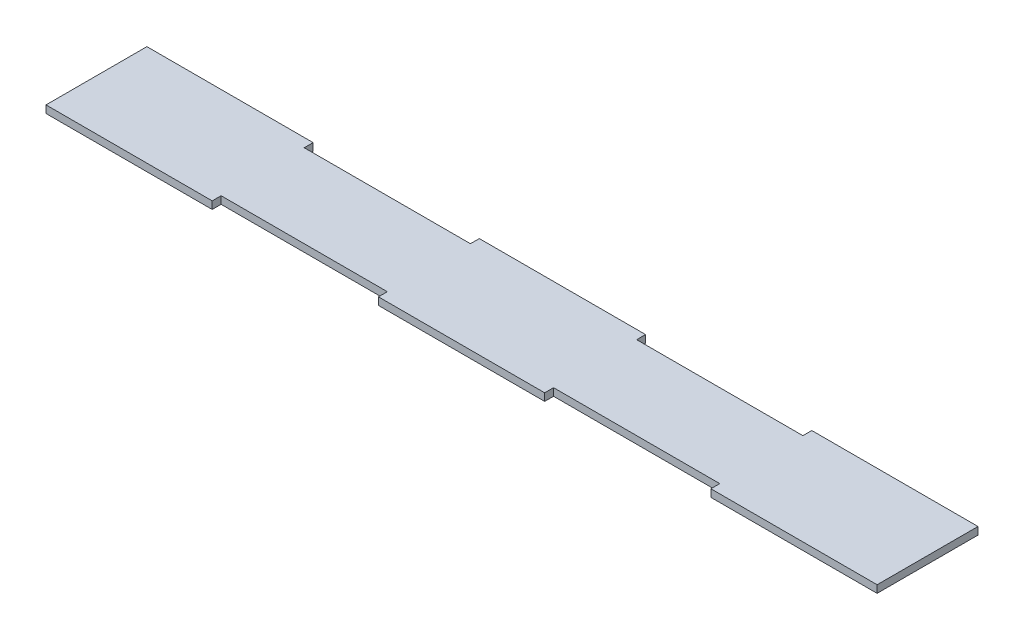
ISO-10303-21;
HEADER;
FILE_DESCRIPTION(('STEP AP214'),'2;1');
FILE_NAME('part.step','',(''),(''),'','','');
FILE_SCHEMA(('AUTOMOTIVE_DESIGN { 1 0 10303 214 1 1 1 1 }'));
ENDSEC;
DATA;
#1=APPLICATION_CONTEXT('core data for automotive mechanical design processes');
#2=APPLICATION_PROTOCOL_DEFINITION('international standard','automotive_design',2000,#1);
#3=PRODUCT_CONTEXT('',#1,'mechanical');
#4=PRODUCT('Part','Part','',(#3));
#5=PRODUCT_RELATED_PRODUCT_CATEGORY('part','',(#4));
#6=PRODUCT_DEFINITION_FORMATION('','',#4);
#7=PRODUCT_DEFINITION_CONTEXT('part definition',#1,'design');
#8=PRODUCT_DEFINITION('design','',#6,#7);
#9=PRODUCT_DEFINITION_SHAPE('','',#8);
#10=(LENGTH_UNIT() NAMED_UNIT(*) SI_UNIT(.MILLI.,.METRE.));
#11=(NAMED_UNIT(*) PLANE_ANGLE_UNIT() SI_UNIT($,.RADIAN.));
#12=(NAMED_UNIT(*) SI_UNIT($,.STERADIAN.) SOLID_ANGLE_UNIT());
#13=UNCERTAINTY_MEASURE_WITH_UNIT(LENGTH_MEASURE(1.E-05),#10,'distance_accuracy_value','');
#14=(GEOMETRIC_REPRESENTATION_CONTEXT(3) GLOBAL_UNCERTAINTY_ASSIGNED_CONTEXT((#13)) GLOBAL_UNIT_ASSIGNED_CONTEXT((#10,
#11,#12)) REPRESENTATION_CONTEXT('',''));
#15=CARTESIAN_POINT('',(0.,0.,0.));
#16=DIRECTION('',(0.,0.,1.));
#17=DIRECTION('',(1.,0.,0.));
#18=AXIS2_PLACEMENT_3D('',#15,#16,#17);
#19=CARTESIAN_POINT('',(150.,2.7,-18.21));
#20=DIRECTION('',(-1.,0.,0.));
#21=DIRECTION('',(0.,0.,1.));
#22=AXIS2_PLACEMENT_3D('',#19,#20,#21);
#23=PLANE('',#22);
#24=DIRECTION('',(0.,0.,-1.));
#25=VECTOR('',#24,1.);
#26=CARTESIAN_POINT('',(150.,0.,-18.21));
#27=LINE('',#26,#25);
#28=CARTESIAN_POINT('',(150.,0.,18.21));
#29=VERTEX_POINT('',#28);
#30=CARTESIAN_POINT('',(150.,0.,-18.21));
#31=VERTEX_POINT('',#30);
#32=EDGE_CURVE('E201',#29,#31,#27,.T.);
#33=ORIENTED_EDGE('',*,*,#32,.T.);
#34=DIRECTION('',(0.,-1.,0.));
#35=VECTOR('',#34,1.);
#36=CARTESIAN_POINT('',(150.,2.7,-18.21));
#37=LINE('',#36,#35);
#38=CARTESIAN_POINT('',(150.,2.7,-18.21));
#39=VERTEX_POINT('',#38);
#40=EDGE_CURVE('E11',#39,#31,#37,.T.);
#41=ORIENTED_EDGE('',*,*,#40,.F.);
#42=DIRECTION('',(0.,0.,-1.));
#43=VECTOR('',#42,1.);
#44=CARTESIAN_POINT('',(150.,2.7,-18.21));
#45=LINE('',#44,#43);
#46=CARTESIAN_POINT('',(150.,2.7,18.21));
#47=VERTEX_POINT('',#46);
#48=EDGE_CURVE('E239',#47,#39,#45,.T.);
#49=ORIENTED_EDGE('',*,*,#48,.F.);
#50=DIRECTION('',(0.,-1.,0.));
#51=VECTOR('',#50,1.);
#52=CARTESIAN_POINT('',(150.,2.7,18.21));
#53=LINE('',#52,#51);
#54=EDGE_CURVE('E197',#47,#29,#53,.T.);
#55=ORIENTED_EDGE('',*,*,#54,.T.);
#56=EDGE_LOOP('',(#33,#41,#49,#55));
#57=FACE_BOUND('',#56,.T.);
#58=ADVANCED_FACE('F33',(#57),#23,.F.);
#59=CARTESIAN_POINT('',(90.,2.7,-18.21));
#60=DIRECTION('',(0.,0.,1.));
#61=DIRECTION('',(1.,0.,0.));
#62=AXIS2_PLACEMENT_3D('',#59,#60,#61);
#63=PLANE('',#62);
#64=DIRECTION('',(-1.,0.,0.));
#65=VECTOR('',#64,1.);
#66=CARTESIAN_POINT('',(90.,0.,-18.21));
#67=LINE('',#66,#65);
#68=CARTESIAN_POINT('',(90.,0.,-18.21));
#69=VERTEX_POINT('',#68);
#70=EDGE_CURVE('E204',#31,#69,#67,.T.);
#71=ORIENTED_EDGE('',*,*,#70,.T.);
#72=DIRECTION('',(0.,-1.,0.));
#73=VECTOR('',#72,1.);
#74=CARTESIAN_POINT('',(90.,2.7,-18.21));
#75=LINE('',#74,#73);
#76=CARTESIAN_POINT('',(90.,2.7,-18.21));
#77=VERTEX_POINT('',#76);
#78=EDGE_CURVE('E41',#77,#69,#75,.T.);
#79=ORIENTED_EDGE('',*,*,#78,.F.);
#80=DIRECTION('',(-1.,0.,0.));
#81=VECTOR('',#80,1.);
#82=CARTESIAN_POINT('',(90.,2.7,-18.21));
#83=LINE('',#82,#81);
#84=EDGE_CURVE('E128',#39,#77,#83,.T.);
#85=ORIENTED_EDGE('',*,*,#84,.F.);
#86=ORIENTED_EDGE('',*,*,#40,.T.);
#87=EDGE_LOOP('',(#71,#79,#85,#86));
#88=FACE_BOUND('',#87,.T.);
#89=ADVANCED_FACE('F357',(#88),#63,.F.);
#90=CARTESIAN_POINT('',(90.,2.7,-18.21));
#91=DIRECTION('',(1.,0.,0.));
#92=DIRECTION('',(0.,0.,-1.));
#93=AXIS2_PLACEMENT_3D('',#90,#91,#92);
#94=PLANE('',#93);
#95=DIRECTION('',(0.,0.,1.));
#96=VECTOR('',#95,1.);
#97=CARTESIAN_POINT('',(90.,0.,-18.21));
#98=LINE('',#97,#96);
#99=CARTESIAN_POINT('',(90.,0.,-15.));
#100=VERTEX_POINT('',#99);
#101=EDGE_CURVE('E206',#69,#100,#98,.T.);
#102=ORIENTED_EDGE('',*,*,#101,.T.);
#103=DIRECTION('',(0.,-1.,0.));
#104=VECTOR('',#103,1.);
#105=CARTESIAN_POINT('',(90.,2.7,-15.));
#106=LINE('',#105,#104);
#107=CARTESIAN_POINT('',(90.,2.7,-15.));
#108=VERTEX_POINT('',#107);
#109=EDGE_CURVE('E282',#108,#100,#106,.T.);
#110=ORIENTED_EDGE('',*,*,#109,.F.);
#111=DIRECTION('',(0.,0.,1.));
#112=VECTOR('',#111,1.);
#113=CARTESIAN_POINT('',(90.,2.7,-18.21));
#114=LINE('',#113,#112);
#115=EDGE_CURVE('E290',#77,#108,#114,.T.);
#116=ORIENTED_EDGE('',*,*,#115,.F.);
#117=ORIENTED_EDGE('',*,*,#78,.T.);
#118=EDGE_LOOP('',(#102,#110,#116,#117));
#119=FACE_BOUND('',#118,.T.);
#120=ADVANCED_FACE('F288',(#119),#94,.F.);
#121=CARTESIAN_POINT('',(30.,2.7,-15.));
#122=DIRECTION('',(0.,0.,1.));
#123=DIRECTION('',(1.,0.,0.));
#124=AXIS2_PLACEMENT_3D('',#121,#122,#123);
#125=PLANE('',#124);
#126=DIRECTION('',(-1.,0.,0.));
#127=VECTOR('',#126,1.);
#128=CARTESIAN_POINT('',(30.,0.,-15.));
#129=LINE('',#128,#127);
#130=CARTESIAN_POINT('',(30.,0.,-15.));
#131=VERTEX_POINT('',#130);
#132=EDGE_CURVE('E208',#100,#131,#129,.T.);
#133=ORIENTED_EDGE('',*,*,#132,.T.);
#134=DIRECTION('',(0.,-1.,0.));
#135=VECTOR('',#134,1.);
#136=CARTESIAN_POINT('',(30.,2.7,-15.));
#137=LINE('',#136,#135);
#138=CARTESIAN_POINT('',(30.,2.7,-15.));
#139=VERTEX_POINT('',#138);
#140=EDGE_CURVE('E279',#139,#131,#137,.T.);
#141=ORIENTED_EDGE('',*,*,#140,.F.);
#142=DIRECTION('',(-1.,0.,0.));
#143=VECTOR('',#142,1.);
#144=CARTESIAN_POINT('',(30.,2.7,-15.));
#145=LINE('',#144,#143);
#146=EDGE_CURVE('E308',#108,#139,#145,.T.);
#147=ORIENTED_EDGE('',*,*,#146,.F.);
#148=ORIENTED_EDGE('',*,*,#109,.T.);
#149=EDGE_LOOP('',(#133,#141,#147,#148));
#150=FACE_BOUND('',#149,.T.);
#151=ADVANCED_FACE('F299',(#150),#125,.F.);
#152=CARTESIAN_POINT('',(30.,2.7,-18.21));
#153=DIRECTION('',(-1.,0.,0.));
#154=DIRECTION('',(0.,0.,1.));
#155=AXIS2_PLACEMENT_3D('',#152,#153,#154);
#156=PLANE('',#155);
#157=DIRECTION('',(0.,0.,-1.));
#158=VECTOR('',#157,1.);
#159=CARTESIAN_POINT('',(30.,0.,-18.21));
#160=LINE('',#159,#158);
#161=CARTESIAN_POINT('',(30.,0.,-18.21));
#162=VERTEX_POINT('',#161);
#163=EDGE_CURVE('E210',#131,#162,#160,.T.);
#164=ORIENTED_EDGE('',*,*,#163,.T.);
#165=DIRECTION('',(0.,-1.,0.));
#166=VECTOR('',#165,1.);
#167=CARTESIAN_POINT('',(30.,2.7,-18.21));
#168=LINE('',#167,#166);
#169=CARTESIAN_POINT('',(30.,2.7,-18.21));
#170=VERTEX_POINT('',#169);
#171=EDGE_CURVE('E276',#170,#162,#168,.T.);
#172=ORIENTED_EDGE('',*,*,#171,.F.);
#173=DIRECTION('',(0.,0.,-1.));
#174=VECTOR('',#173,1.);
#175=CARTESIAN_POINT('',(30.,2.7,-18.21));
#176=LINE('',#175,#174);
#177=EDGE_CURVE('E305',#139,#170,#176,.T.);
#178=ORIENTED_EDGE('',*,*,#177,.F.);
#179=ORIENTED_EDGE('',*,*,#140,.T.);
#180=EDGE_LOOP('',(#164,#172,#178,#179));
#181=FACE_BOUND('',#180,.T.);
#182=ADVANCED_FACE('F303',(#181),#156,.F.);
#183=CARTESIAN_POINT('',(-30.,2.7,-18.21));
#184=DIRECTION('',(0.,0.,1.));
#185=DIRECTION('',(1.,0.,0.));
#186=AXIS2_PLACEMENT_3D('',#183,#184,#185);
#187=PLANE('',#186);
#188=DIRECTION('',(-1.,0.,0.));
#189=VECTOR('',#188,1.);
#190=CARTESIAN_POINT('',(-30.,0.,-18.21));
#191=LINE('',#190,#189);
#192=CARTESIAN_POINT('',(-30.,0.,-18.21));
#193=VERTEX_POINT('',#192);
#194=EDGE_CURVE('E212',#162,#193,#191,.T.);
#195=ORIENTED_EDGE('',*,*,#194,.T.);
#196=DIRECTION('',(0.,-1.,0.));
#197=VECTOR('',#196,1.);
#198=CARTESIAN_POINT('',(-30.,2.7,-18.21));
#199=LINE('',#198,#197);
#200=CARTESIAN_POINT('',(-30.,2.7,-18.21));
#201=VERTEX_POINT('',#200);
#202=EDGE_CURVE('E273',#201,#193,#199,.T.);
#203=ORIENTED_EDGE('',*,*,#202,.F.);
#204=DIRECTION('',(-1.,0.,0.));
#205=VECTOR('',#204,1.);
#206=CARTESIAN_POINT('',(-30.,2.7,-18.21));
#207=LINE('',#206,#205);
#208=EDGE_CURVE('E307',#170,#201,#207,.T.);
#209=ORIENTED_EDGE('',*,*,#208,.F.);
#210=ORIENTED_EDGE('',*,*,#171,.T.);
#211=EDGE_LOOP('',(#195,#203,#209,#210));
#212=FACE_BOUND('',#211,.T.);
#213=ADVANCED_FACE('F370',(#212),#187,.F.);
#214=CARTESIAN_POINT('',(-30.,2.7,-18.21));
#215=DIRECTION('',(1.,0.,0.));
#216=DIRECTION('',(0.,0.,-1.));
#217=AXIS2_PLACEMENT_3D('',#214,#215,#216);
#218=PLANE('',#217);
#219=DIRECTION('',(0.,0.,1.));
#220=VECTOR('',#219,1.);
#221=CARTESIAN_POINT('',(-30.,0.,-18.21));
#222=LINE('',#221,#220);
#223=CARTESIAN_POINT('',(-30.,0.,-15.));
#224=VERTEX_POINT('',#223);
#225=EDGE_CURVE('E214',#193,#224,#222,.T.);
#226=ORIENTED_EDGE('',*,*,#225,.T.);
#227=DIRECTION('',(0.,-1.,0.));
#228=VECTOR('',#227,1.);
#229=CARTESIAN_POINT('',(-30.,2.7,-15.));
#230=LINE('',#229,#228);
#231=CARTESIAN_POINT('',(-30.,2.7,-15.));
#232=VERTEX_POINT('',#231);
#233=EDGE_CURVE('E270',#232,#224,#230,.T.);
#234=ORIENTED_EDGE('',*,*,#233,.F.);
#235=DIRECTION('',(0.,0.,1.));
#236=VECTOR('',#235,1.);
#237=CARTESIAN_POINT('',(-30.,2.7,-18.21));
#238=LINE('',#237,#236);
#239=EDGE_CURVE('E310',#201,#232,#238,.T.);
#240=ORIENTED_EDGE('',*,*,#239,.F.);
#241=ORIENTED_EDGE('',*,*,#202,.T.);
#242=EDGE_LOOP('',(#226,#234,#240,#241));
#243=FACE_BOUND('',#242,.T.);
#244=ADVANCED_FACE('F373',(#243),#218,.F.);
#245=CARTESIAN_POINT('',(-90.,2.7,-15.));
#246=DIRECTION('',(0.,0.,1.));
#247=DIRECTION('',(1.,0.,0.));
#248=AXIS2_PLACEMENT_3D('',#245,#246,#247);
#249=PLANE('',#248);
#250=DIRECTION('',(-1.,0.,0.));
#251=VECTOR('',#250,1.);
#252=CARTESIAN_POINT('',(-90.,0.,-15.));
#253=LINE('',#252,#251);
#254=CARTESIAN_POINT('',(-90.,0.,-15.));
#255=VERTEX_POINT('',#254);
#256=EDGE_CURVE('E216',#224,#255,#253,.T.);
#257=ORIENTED_EDGE('',*,*,#256,.T.);
#258=DIRECTION('',(0.,-1.,0.));
#259=VECTOR('',#258,1.);
#260=CARTESIAN_POINT('',(-90.,2.7,-15.));
#261=LINE('',#260,#259);
#262=CARTESIAN_POINT('',(-90.,2.7,-15.));
#263=VERTEX_POINT('',#262);
#264=EDGE_CURVE('E267',#263,#255,#261,.T.);
#265=ORIENTED_EDGE('',*,*,#264,.F.);
#266=DIRECTION('',(-1.,0.,0.));
#267=VECTOR('',#266,1.);
#268=CARTESIAN_POINT('',(-90.,2.7,-15.));
#269=LINE('',#268,#267);
#270=EDGE_CURVE('E316',#232,#263,#269,.T.);
#271=ORIENTED_EDGE('',*,*,#270,.F.);
#272=ORIENTED_EDGE('',*,*,#233,.T.);
#273=EDGE_LOOP('',(#257,#265,#271,#272));
#274=FACE_BOUND('',#273,.T.);
#275=ADVANCED_FACE('F377',(#274),#249,.F.);
#276=CARTESIAN_POINT('',(-90.,2.7,-18.21));
#277=DIRECTION('',(-1.,0.,0.));
#278=DIRECTION('',(0.,0.,1.));
#279=AXIS2_PLACEMENT_3D('',#276,#277,#278);
#280=PLANE('',#279);
#281=DIRECTION('',(0.,0.,-1.));
#282=VECTOR('',#281,1.);
#283=CARTESIAN_POINT('',(-90.,0.,-18.21));
#284=LINE('',#283,#282);
#285=CARTESIAN_POINT('',(-90.,0.,-18.21));
#286=VERTEX_POINT('',#285);
#287=EDGE_CURVE('E218',#255,#286,#284,.T.);
#288=ORIENTED_EDGE('',*,*,#287,.T.);
#289=DIRECTION('',(0.,-1.,0.));
#290=VECTOR('',#289,1.);
#291=CARTESIAN_POINT('',(-90.,2.7,-18.21));
#292=LINE('',#291,#290);
#293=CARTESIAN_POINT('',(-90.,2.7,-18.21));
#294=VERTEX_POINT('',#293);
#295=EDGE_CURVE('E264',#294,#286,#292,.T.);
#296=ORIENTED_EDGE('',*,*,#295,.F.);
#297=DIRECTION('',(0.,0.,-1.));
#298=VECTOR('',#297,1.);
#299=CARTESIAN_POINT('',(-90.,2.7,-18.21));
#300=LINE('',#299,#298);
#301=EDGE_CURVE('E318',#263,#294,#300,.T.);
#302=ORIENTED_EDGE('',*,*,#301,.F.);
#303=ORIENTED_EDGE('',*,*,#264,.T.);
#304=EDGE_LOOP('',(#288,#296,#302,#303));
#305=FACE_BOUND('',#304,.T.);
#306=ADVANCED_FACE('F381',(#305),#280,.F.);
#307=CARTESIAN_POINT('',(-150.,2.7,-18.21));
#308=DIRECTION('',(0.,0.,1.));
#309=DIRECTION('',(1.,0.,0.));
#310=AXIS2_PLACEMENT_3D('',#307,#308,#309);
#311=PLANE('',#310);
#312=DIRECTION('',(-1.,0.,0.));
#313=VECTOR('',#312,1.);
#314=CARTESIAN_POINT('',(-150.,0.,-18.21));
#315=LINE('',#314,#313);
#316=CARTESIAN_POINT('',(-150.,0.,-18.21));
#317=VERTEX_POINT('',#316);
#318=EDGE_CURVE('E220',#286,#317,#315,.T.);
#319=ORIENTED_EDGE('',*,*,#318,.T.);
#320=DIRECTION('',(0.,-1.,0.));
#321=VECTOR('',#320,1.);
#322=CARTESIAN_POINT('',(-150.,2.7,-18.21));
#323=LINE('',#322,#321);
#324=CARTESIAN_POINT('',(-150.,2.7,-18.21));
#325=VERTEX_POINT('',#324);
#326=EDGE_CURVE('E261',#325,#317,#323,.T.);
#327=ORIENTED_EDGE('',*,*,#326,.F.);
#328=DIRECTION('',(-1.,0.,0.));
#329=VECTOR('',#328,1.);
#330=CARTESIAN_POINT('',(-150.,2.7,-18.21));
#331=LINE('',#330,#329);
#332=EDGE_CURVE('E320',#294,#325,#331,.T.);
#333=ORIENTED_EDGE('',*,*,#332,.F.);
#334=ORIENTED_EDGE('',*,*,#295,.T.);
#335=EDGE_LOOP('',(#319,#327,#333,#334));
#336=FACE_BOUND('',#335,.T.);
#337=ADVANCED_FACE('F385',(#336),#311,.F.);
#338=CARTESIAN_POINT('',(-150.,2.7,-18.21));
#339=DIRECTION('',(1.,0.,0.));
#340=DIRECTION('',(0.,0.,-1.));
#341=AXIS2_PLACEMENT_3D('',#338,#339,#340);
#342=PLANE('',#341);
#343=DIRECTION('',(0.,0.,1.));
#344=VECTOR('',#343,1.);
#345=CARTESIAN_POINT('',(-150.,0.,-18.21));
#346=LINE('',#345,#344);
#347=CARTESIAN_POINT('',(-150.,0.,18.21));
#348=VERTEX_POINT('',#347);
#349=EDGE_CURVE('E222',#317,#348,#346,.T.);
#350=ORIENTED_EDGE('',*,*,#349,.T.);
#351=DIRECTION('',(0.,-1.,0.));
#352=VECTOR('',#351,1.);
#353=CARTESIAN_POINT('',(-150.,2.7,18.21));
#354=LINE('',#353,#352);
#355=CARTESIAN_POINT('',(-150.,2.7,18.21));
#356=VERTEX_POINT('',#355);
#357=EDGE_CURVE('E258',#356,#348,#354,.T.);
#358=ORIENTED_EDGE('',*,*,#357,.F.);
#359=DIRECTION('',(0.,0.,1.));
#360=VECTOR('',#359,1.);
#361=CARTESIAN_POINT('',(-150.,2.7,-18.21));
#362=LINE('',#361,#360);
#363=EDGE_CURVE('E322',#325,#356,#362,.T.);
#364=ORIENTED_EDGE('',*,*,#363,.F.);
#365=ORIENTED_EDGE('',*,*,#326,.T.);
#366=EDGE_LOOP('',(#350,#358,#364,#365));
#367=FACE_BOUND('',#366,.T.);
#368=ADVANCED_FACE('F389',(#367),#342,.F.);
#369=CARTESIAN_POINT('',(-150.,2.7,18.21));
#370=DIRECTION('',(0.,0.,-1.));
#371=DIRECTION('',(-1.,0.,0.));
#372=AXIS2_PLACEMENT_3D('',#369,#370,#371);
#373=PLANE('',#372);
#374=DIRECTION('',(1.,0.,0.));
#375=VECTOR('',#374,1.);
#376=CARTESIAN_POINT('',(-150.,0.,18.21));
#377=LINE('',#376,#375);
#378=CARTESIAN_POINT('',(-90.,0.,18.21));
#379=VERTEX_POINT('',#378);
#380=EDGE_CURVE('E224',#348,#379,#377,.T.);
#381=ORIENTED_EDGE('',*,*,#380,.T.);
#382=DIRECTION('',(0.,-1.,0.));
#383=VECTOR('',#382,1.);
#384=CARTESIAN_POINT('',(-90.,2.7,18.21));
#385=LINE('',#384,#383);
#386=CARTESIAN_POINT('',(-90.,2.7,18.21));
#387=VERTEX_POINT('',#386);
#388=EDGE_CURVE('E255',#387,#379,#385,.T.);
#389=ORIENTED_EDGE('',*,*,#388,.F.);
#390=DIRECTION('',(1.,0.,0.));
#391=VECTOR('',#390,1.);
#392=CARTESIAN_POINT('',(-150.,2.7,18.21));
#393=LINE('',#392,#391);
#394=EDGE_CURVE('E324',#356,#387,#393,.T.);
#395=ORIENTED_EDGE('',*,*,#394,.F.);
#396=ORIENTED_EDGE('',*,*,#357,.T.);
#397=EDGE_LOOP('',(#381,#389,#395,#396));
#398=FACE_BOUND('',#397,.T.);
#399=ADVANCED_FACE('F393',(#398),#373,.F.);
#400=CARTESIAN_POINT('',(-90.,2.7,15.));
#401=DIRECTION('',(-1.,0.,0.));
#402=DIRECTION('',(0.,0.,1.));
#403=AXIS2_PLACEMENT_3D('',#400,#401,#402);
#404=PLANE('',#403);
#405=DIRECTION('',(0.,0.,-1.));
#406=VECTOR('',#405,1.);
#407=CARTESIAN_POINT('',(-90.,0.,15.));
#408=LINE('',#407,#406);
#409=CARTESIAN_POINT('',(-90.,0.,15.));
#410=VERTEX_POINT('',#409);
#411=EDGE_CURVE('E226',#379,#410,#408,.T.);
#412=ORIENTED_EDGE('',*,*,#411,.T.);
#413=DIRECTION('',(0.,-1.,0.));
#414=VECTOR('',#413,1.);
#415=CARTESIAN_POINT('',(-90.,2.7,15.));
#416=LINE('',#415,#414);
#417=CARTESIAN_POINT('',(-90.,2.7,15.));
#418=VERTEX_POINT('',#417);
#419=EDGE_CURVE('E252',#418,#410,#416,.T.);
#420=ORIENTED_EDGE('',*,*,#419,.F.);
#421=DIRECTION('',(0.,0.,-1.));
#422=VECTOR('',#421,1.);
#423=CARTESIAN_POINT('',(-90.,2.7,15.));
#424=LINE('',#423,#422);
#425=EDGE_CURVE('E326',#387,#418,#424,.T.);
#426=ORIENTED_EDGE('',*,*,#425,.F.);
#427=ORIENTED_EDGE('',*,*,#388,.T.);
#428=EDGE_LOOP('',(#412,#420,#426,#427));
#429=FACE_BOUND('',#428,.T.);
#430=ADVANCED_FACE('F397',(#429),#404,.F.);
#431=CARTESIAN_POINT('',(-90.,2.7,15.));
#432=DIRECTION('',(0.,0.,-1.));
#433=DIRECTION('',(-1.,0.,0.));
#434=AXIS2_PLACEMENT_3D('',#431,#432,#433);
#435=PLANE('',#434);
#436=DIRECTION('',(1.,0.,0.));
#437=VECTOR('',#436,1.);
#438=CARTESIAN_POINT('',(-90.,0.,15.));
#439=LINE('',#438,#437);
#440=CARTESIAN_POINT('',(-30.,0.,15.));
#441=VERTEX_POINT('',#440);
#442=EDGE_CURVE('E228',#410,#441,#439,.T.);
#443=ORIENTED_EDGE('',*,*,#442,.T.);
#444=DIRECTION('',(0.,-1.,0.));
#445=VECTOR('',#444,1.);
#446=CARTESIAN_POINT('',(-30.,2.7,15.));
#447=LINE('',#446,#445);
#448=CARTESIAN_POINT('',(-30.,2.7,15.));
#449=VERTEX_POINT('',#448);
#450=EDGE_CURVE('E249',#449,#441,#447,.T.);
#451=ORIENTED_EDGE('',*,*,#450,.F.);
#452=DIRECTION('',(1.,0.,0.));
#453=VECTOR('',#452,1.);
#454=CARTESIAN_POINT('',(-90.,2.7,15.));
#455=LINE('',#454,#453);
#456=EDGE_CURVE('E328',#418,#449,#455,.T.);
#457=ORIENTED_EDGE('',*,*,#456,.F.);
#458=ORIENTED_EDGE('',*,*,#419,.T.);
#459=EDGE_LOOP('',(#443,#451,#457,#458));
#460=FACE_BOUND('',#459,.T.);
#461=ADVANCED_FACE('F401',(#460),#435,.F.);
#462=CARTESIAN_POINT('',(-30.,2.7,18.21));
#463=DIRECTION('',(1.,0.,0.));
#464=DIRECTION('',(0.,0.,-1.));
#465=AXIS2_PLACEMENT_3D('',#462,#463,#464);
#466=PLANE('',#465);
#467=DIRECTION('',(0.,0.,1.));
#468=VECTOR('',#467,1.);
#469=CARTESIAN_POINT('',(-30.,0.,18.21));
#470=LINE('',#469,#468);
#471=CARTESIAN_POINT('',(-30.,0.,18.21));
#472=VERTEX_POINT('',#471);
#473=EDGE_CURVE('E230',#441,#472,#470,.T.);
#474=ORIENTED_EDGE('',*,*,#473,.T.);
#475=DIRECTION('',(0.,-1.,0.));
#476=VECTOR('',#475,1.);
#477=CARTESIAN_POINT('',(-30.,2.7,18.21));
#478=LINE('',#477,#476);
#479=CARTESIAN_POINT('',(-30.,2.7,18.21));
#480=VERTEX_POINT('',#479);
#481=EDGE_CURVE('E246',#480,#472,#478,.T.);
#482=ORIENTED_EDGE('',*,*,#481,.F.);
#483=DIRECTION('',(0.,0.,1.));
#484=VECTOR('',#483,1.);
#485=CARTESIAN_POINT('',(-30.,2.7,18.21));
#486=LINE('',#485,#484);
#487=EDGE_CURVE('E330',#449,#480,#486,.T.);
#488=ORIENTED_EDGE('',*,*,#487,.F.);
#489=ORIENTED_EDGE('',*,*,#450,.T.);
#490=EDGE_LOOP('',(#474,#482,#488,#489));
#491=FACE_BOUND('',#490,.T.);
#492=ADVANCED_FACE('F405',(#491),#466,.F.);
#493=CARTESIAN_POINT('',(-30.,2.7,18.21));
#494=DIRECTION('',(0.,0.,-1.));
#495=DIRECTION('',(-1.,0.,0.));
#496=AXIS2_PLACEMENT_3D('',#493,#494,#495);
#497=PLANE('',#496);
#498=DIRECTION('',(1.,0.,0.));
#499=VECTOR('',#498,1.);
#500=CARTESIAN_POINT('',(-30.,0.,18.21));
#501=LINE('',#500,#499);
#502=CARTESIAN_POINT('',(30.,0.,18.21));
#503=VERTEX_POINT('',#502);
#504=EDGE_CURVE('E232',#472,#503,#501,.T.);
#505=ORIENTED_EDGE('',*,*,#504,.T.);
#506=DIRECTION('',(0.,-1.,0.));
#507=VECTOR('',#506,1.);
#508=CARTESIAN_POINT('',(30.,2.7,18.21));
#509=LINE('',#508,#507);
#510=CARTESIAN_POINT('',(30.,2.7,18.21));
#511=VERTEX_POINT('',#510);
#512=EDGE_CURVE('E243',#511,#503,#509,.T.);
#513=ORIENTED_EDGE('',*,*,#512,.F.);
#514=DIRECTION('',(1.,0.,0.));
#515=VECTOR('',#514,1.);
#516=CARTESIAN_POINT('',(-30.,2.7,18.21));
#517=LINE('',#516,#515);
#518=EDGE_CURVE('E332',#480,#511,#517,.T.);
#519=ORIENTED_EDGE('',*,*,#518,.F.);
#520=ORIENTED_EDGE('',*,*,#481,.T.);
#521=EDGE_LOOP('',(#505,#513,#519,#520));
#522=FACE_BOUND('',#521,.T.);
#523=ADVANCED_FACE('F338',(#522),#497,.F.);
#524=CARTESIAN_POINT('',(30.,2.7,18.21));
#525=DIRECTION('',(-1.,0.,0.));
#526=DIRECTION('',(0.,0.,1.));
#527=AXIS2_PLACEMENT_3D('',#524,#525,#526);
#528=PLANE('',#527);
#529=DIRECTION('',(0.,0.,-1.));
#530=VECTOR('',#529,1.);
#531=CARTESIAN_POINT('',(30.,0.,18.21));
#532=LINE('',#531,#530);
#533=CARTESIAN_POINT('',(30.,0.,15.));
#534=VERTEX_POINT('',#533);
#535=EDGE_CURVE('E234',#503,#534,#532,.T.);
#536=ORIENTED_EDGE('',*,*,#535,.T.);
#537=DIRECTION('',(0.,-1.,0.));
#538=VECTOR('',#537,1.);
#539=CARTESIAN_POINT('',(30.,2.7,15.));
#540=LINE('',#539,#538);
#541=CARTESIAN_POINT('',(30.,2.7,15.));
#542=VERTEX_POINT('',#541);
#543=EDGE_CURVE('E192',#542,#534,#540,.T.);
#544=ORIENTED_EDGE('',*,*,#543,.F.);
#545=DIRECTION('',(0.,0.,-1.));
#546=VECTOR('',#545,1.);
#547=CARTESIAN_POINT('',(30.,2.7,18.21));
#548=LINE('',#547,#546);
#549=EDGE_CURVE('E183',#511,#542,#548,.T.);
#550=ORIENTED_EDGE('',*,*,#549,.F.);
#551=ORIENTED_EDGE('',*,*,#512,.T.);
#552=EDGE_LOOP('',(#536,#544,#550,#551));
#553=FACE_BOUND('',#552,.T.);
#554=ADVANCED_FACE('F342',(#553),#528,.F.);
#555=CARTESIAN_POINT('',(30.,2.7,15.));
#556=DIRECTION('',(0.,0.,-1.));
#557=DIRECTION('',(-1.,0.,0.));
#558=AXIS2_PLACEMENT_3D('',#555,#556,#557);
#559=PLANE('',#558);
#560=DIRECTION('',(1.,0.,0.));
#561=VECTOR('',#560,1.);
#562=CARTESIAN_POINT('',(30.,0.,15.));
#563=LINE('',#562,#561);
#564=CARTESIAN_POINT('',(90.,0.,15.));
#565=VERTEX_POINT('',#564);
#566=EDGE_CURVE('E191',#534,#565,#563,.T.);
#567=ORIENTED_EDGE('',*,*,#566,.T.);
#568=DIRECTION('',(0.,-1.,0.));
#569=VECTOR('',#568,1.);
#570=CARTESIAN_POINT('',(90.,2.7,15.));
#571=LINE('',#570,#569);
#572=CARTESIAN_POINT('',(90.,2.7,15.));
#573=VERTEX_POINT('',#572);
#574=EDGE_CURVE('E188',#573,#565,#571,.T.);
#575=ORIENTED_EDGE('',*,*,#574,.F.);
#576=DIRECTION('',(1.,0.,0.));
#577=VECTOR('',#576,1.);
#578=CARTESIAN_POINT('',(30.,2.7,15.));
#579=LINE('',#578,#577);
#580=EDGE_CURVE('E177',#542,#573,#579,.T.);
#581=ORIENTED_EDGE('',*,*,#580,.F.);
#582=ORIENTED_EDGE('',*,*,#543,.T.);
#583=EDGE_LOOP('',(#567,#575,#581,#582));
#584=FACE_BOUND('',#583,.T.);
#585=ADVANCED_FACE('F189',(#584),#559,.F.);
#586=CARTESIAN_POINT('',(90.,2.7,18.21));
#587=DIRECTION('',(1.,0.,0.));
#588=DIRECTION('',(0.,0.,-1.));
#589=AXIS2_PLACEMENT_3D('',#586,#587,#588);
#590=PLANE('',#589);
#591=DIRECTION('',(0.,0.,1.));
#592=VECTOR('',#591,1.);
#593=CARTESIAN_POINT('',(90.,0.,18.21));
#594=LINE('',#593,#592);
#595=CARTESIAN_POINT('',(90.,0.,18.21));
#596=VERTEX_POINT('',#595);
#597=EDGE_CURVE('E114',#565,#596,#594,.T.);
#598=ORIENTED_EDGE('',*,*,#597,.T.);
#599=DIRECTION('',(0.,-1.,0.));
#600=VECTOR('',#599,1.);
#601=CARTESIAN_POINT('',(90.,2.7,18.21));
#602=LINE('',#601,#600);
#603=CARTESIAN_POINT('',(90.,2.7,18.21));
#604=VERTEX_POINT('',#603);
#605=EDGE_CURVE('E193',#604,#596,#602,.T.);
#606=ORIENTED_EDGE('',*,*,#605,.F.);
#607=DIRECTION('',(0.,0.,1.));
#608=VECTOR('',#607,1.);
#609=CARTESIAN_POINT('',(90.,2.7,18.21));
#610=LINE('',#609,#608);
#611=EDGE_CURVE('E181',#573,#604,#610,.T.);
#612=ORIENTED_EDGE('',*,*,#611,.F.);
#613=ORIENTED_EDGE('',*,*,#574,.T.);
#614=EDGE_LOOP('',(#598,#606,#612,#613));
#615=FACE_BOUND('',#614,.T.);
#616=ADVANCED_FACE('F195',(#615),#590,.F.);
#617=CARTESIAN_POINT('',(90.,2.7,18.21));
#618=DIRECTION('',(0.,0.,-1.));
#619=DIRECTION('',(-1.,0.,0.));
#620=AXIS2_PLACEMENT_3D('',#617,#618,#619);
#621=PLANE('',#620);
#622=DIRECTION('',(1.,0.,0.));
#623=VECTOR('',#622,1.);
#624=CARTESIAN_POINT('',(90.,0.,18.21));
#625=LINE('',#624,#623);
#626=EDGE_CURVE('E120',#596,#29,#625,.T.);
#627=ORIENTED_EDGE('',*,*,#626,.T.);
#628=ORIENTED_EDGE('',*,*,#54,.F.);
#629=DIRECTION('',(1.,0.,0.));
#630=VECTOR('',#629,1.);
#631=CARTESIAN_POINT('',(90.,2.7,18.21));
#632=LINE('',#631,#630);
#633=EDGE_CURVE('E49',#604,#47,#632,.T.);
#634=ORIENTED_EDGE('',*,*,#633,.F.);
#635=ORIENTED_EDGE('',*,*,#605,.T.);
#636=EDGE_LOOP('',(#627,#628,#634,#635));
#637=FACE_BOUND('',#636,.T.);
#638=ADVANCED_FACE('F346',(#637),#621,.F.);
#639=CARTESIAN_POINT('',(0.,2.7,0.));
#640=DIRECTION('',(0.,1.,0.));
#641=DIRECTION('',(0.,0.,1.));
#642=AXIS2_PLACEMENT_3D('',#639,#640,#641);
#643=PLANE('',#642);
#644=ORIENTED_EDGE('',*,*,#48,.T.);
#645=ORIENTED_EDGE('',*,*,#84,.T.);
#646=ORIENTED_EDGE('',*,*,#115,.T.);
#647=ORIENTED_EDGE('',*,*,#146,.T.);
#648=ORIENTED_EDGE('',*,*,#177,.T.);
#649=ORIENTED_EDGE('',*,*,#208,.T.);
#650=ORIENTED_EDGE('',*,*,#239,.T.);
#651=ORIENTED_EDGE('',*,*,#270,.T.);
#652=ORIENTED_EDGE('',*,*,#301,.T.);
#653=ORIENTED_EDGE('',*,*,#332,.T.);
#654=ORIENTED_EDGE('',*,*,#363,.T.);
#655=ORIENTED_EDGE('',*,*,#394,.T.);
#656=ORIENTED_EDGE('',*,*,#425,.T.);
#657=ORIENTED_EDGE('',*,*,#456,.T.);
#658=ORIENTED_EDGE('',*,*,#487,.T.);
#659=ORIENTED_EDGE('',*,*,#518,.T.);
#660=ORIENTED_EDGE('',*,*,#549,.T.);
#661=ORIENTED_EDGE('',*,*,#580,.T.);
#662=ORIENTED_EDGE('',*,*,#611,.T.);
#663=ORIENTED_EDGE('',*,*,#633,.T.);
#664=EDGE_LOOP('',(#644,#645,#646,#647,#648,#649,#650,#651,#652,#653,#654,#655,#656,#657,#658,
#659,#660,#661,#662,#663));
#665=FACE_BOUND('',#664,.T.);
#666=ADVANCED_FACE('F179',(#665),#643,.T.);
#667=CARTESIAN_POINT('',(0.,0.,0.));
#668=DIRECTION('',(0.,1.,0.));
#669=DIRECTION('',(0.,0.,1.));
#670=AXIS2_PLACEMENT_3D('',#667,#668,#669);
#671=PLANE('',#670);
#672=ORIENTED_EDGE('',*,*,#32,.F.);
#673=ORIENTED_EDGE('',*,*,#626,.F.);
#674=ORIENTED_EDGE('',*,*,#597,.F.);
#675=ORIENTED_EDGE('',*,*,#566,.F.);
#676=ORIENTED_EDGE('',*,*,#535,.F.);
#677=ORIENTED_EDGE('',*,*,#504,.F.);
#678=ORIENTED_EDGE('',*,*,#473,.F.);
#679=ORIENTED_EDGE('',*,*,#442,.F.);
#680=ORIENTED_EDGE('',*,*,#411,.F.);
#681=ORIENTED_EDGE('',*,*,#380,.F.);
#682=ORIENTED_EDGE('',*,*,#349,.F.);
#683=ORIENTED_EDGE('',*,*,#318,.F.);
#684=ORIENTED_EDGE('',*,*,#287,.F.);
#685=ORIENTED_EDGE('',*,*,#256,.F.);
#686=ORIENTED_EDGE('',*,*,#225,.F.);
#687=ORIENTED_EDGE('',*,*,#194,.F.);
#688=ORIENTED_EDGE('',*,*,#163,.F.);
#689=ORIENTED_EDGE('',*,*,#132,.F.);
#690=ORIENTED_EDGE('',*,*,#101,.F.);
#691=ORIENTED_EDGE('',*,*,#70,.F.);
#692=EDGE_LOOP('',(#672,#673,#674,#675,#676,#677,#678,#679,#680,#681,#682,#683,#684,#685,#686,
#687,#688,#689,#690,#691));
#693=FACE_BOUND('',#692,.T.);
#694=ADVANCED_FACE('F294',(#693),#671,.F.);
#695=CLOSED_SHELL('',(#58,#89,#120,#151,#182,#213,#244,#275,#306,#337,#368,#399,#430,#461,#492,
#523,#554,#585,#616,#638,#666,#694));
#696=MANIFOLD_SOLID_BREP('B2',#695);
#697=ADVANCED_BREP_SHAPE_REPRESENTATION('',(#18,#696),#14);
#698=SHAPE_DEFINITION_REPRESENTATION(#9,#697);
ENDSEC;
END-ISO-10303-21;
